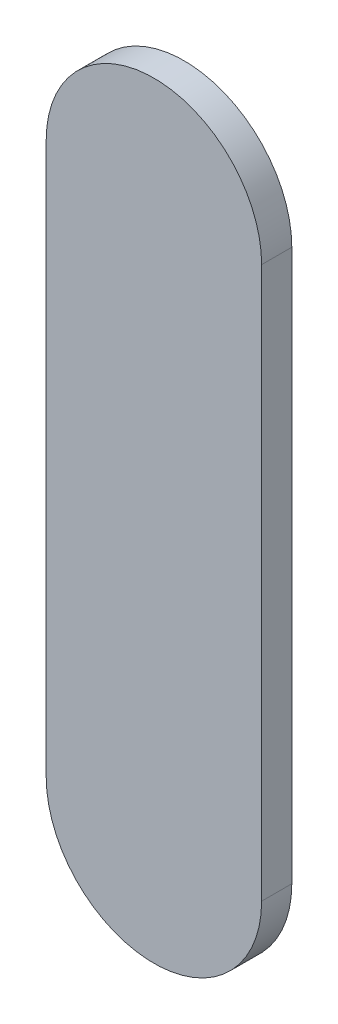
ISO-10303-21;
HEADER;
FILE_DESCRIPTION(('STEP AP214'),'2;1');
FILE_NAME('part.step','',(''),(''),'','','');
FILE_SCHEMA(('AUTOMOTIVE_DESIGN { 1 0 10303 214 1 1 1 1 }'));
ENDSEC;
DATA;
#1=APPLICATION_CONTEXT('core data for automotive mechanical design processes');
#2=APPLICATION_PROTOCOL_DEFINITION('international standard','automotive_design',2000,#1);
#3=PRODUCT_CONTEXT('',#1,'mechanical');
#4=PRODUCT('Part','Part','',(#3));
#5=PRODUCT_RELATED_PRODUCT_CATEGORY('part','',(#4));
#6=PRODUCT_DEFINITION_FORMATION('','',#4);
#7=PRODUCT_DEFINITION_CONTEXT('part definition',#1,'design');
#8=PRODUCT_DEFINITION('design','',#6,#7);
#9=PRODUCT_DEFINITION_SHAPE('','',#8);
#10=(LENGTH_UNIT() NAMED_UNIT(*) SI_UNIT(.MILLI.,.METRE.));
#11=(NAMED_UNIT(*) PLANE_ANGLE_UNIT() SI_UNIT($,.RADIAN.));
#12=(NAMED_UNIT(*) SI_UNIT($,.STERADIAN.) SOLID_ANGLE_UNIT());
#13=UNCERTAINTY_MEASURE_WITH_UNIT(LENGTH_MEASURE(1.E-05),#10,'distance_accuracy_value','');
#14=(GEOMETRIC_REPRESENTATION_CONTEXT(3) GLOBAL_UNCERTAINTY_ASSIGNED_CONTEXT((#13)) GLOBAL_UNIT_ASSIGNED_CONTEXT((#10,
#11,#12)) REPRESENTATION_CONTEXT('',''));
#15=CARTESIAN_POINT('',(0.,0.,0.));
#16=DIRECTION('',(0.,0.,1.));
#17=DIRECTION('',(1.,0.,0.));
#18=AXIS2_PLACEMENT_3D('',#15,#16,#17);
#19=CARTESIAN_POINT('',(95.394018,83.5370186,0.));
#20=DIRECTION('',(-1.,0.,0.));
#21=DIRECTION('',(0.,1.,0.));
#22=AXIS2_PLACEMENT_3D('',#19,#20,#21);
#23=PLANE('',#22);
#24=DIRECTION('',(0.,1.,0.));
#25=VECTOR('',#24,1.);
#26=CARTESIAN_POINT('',(95.394018,83.5370186,0.03556));
#27=LINE('',#26,#25);
#28=CARTESIAN_POINT('',(95.394018,83.5370186,0.03556));
#29=VERTEX_POINT('',#28);
#30=CARTESIAN_POINT('',(95.394018,84.1869284,0.03556));
#31=VERTEX_POINT('',#30);
#32=EDGE_CURVE('E11',#29,#31,#27,.T.);
#33=ORIENTED_EDGE('',*,*,#32,.F.);
#34=DIRECTION('',(0.,0.,1.));
#35=VECTOR('',#34,1.);
#36=CARTESIAN_POINT('',(95.394018,83.5370186,0.));
#37=LINE('',#36,#35);
#38=CARTESIAN_POINT('',(95.394018,83.5370186,0.));
#39=VERTEX_POINT('',#38);
#40=EDGE_CURVE('E24',#39,#29,#37,.T.);
#41=ORIENTED_EDGE('',*,*,#40,.F.);
#42=DIRECTION('',(0.,1.,0.));
#43=VECTOR('',#42,1.);
#44=CARTESIAN_POINT('',(95.394018,83.5370186,0.));
#45=LINE('',#44,#43);
#46=CARTESIAN_POINT('',(95.394018,84.1869284,0.));
#47=VERTEX_POINT('',#46);
#48=EDGE_CURVE('E75',#39,#47,#45,.T.);
#49=ORIENTED_EDGE('',*,*,#48,.T.);
#50=DIRECTION('',(0.,0.,1.));
#51=VECTOR('',#50,1.);
#52=CARTESIAN_POINT('',(95.394018,84.1869284,0.));
#53=LINE('',#52,#51);
#54=EDGE_CURVE('E37',#47,#31,#53,.T.);
#55=ORIENTED_EDGE('',*,*,#54,.T.);
#56=EDGE_LOOP('',(#33,#41,#49,#55));
#57=FACE_BOUND('',#56,.T.);
#58=ADVANCED_FACE('F17',(#57),#23,.F.);
#59=CARTESIAN_POINT('',(95.267018,84.1869284,0.));
#60=DIRECTION('',(0.,0.,-1.));
#61=DIRECTION('',(1.,-1.11896493820492E-13,0.));
#62=AXIS2_PLACEMENT_3D('',#59,#60,#61);
#63=CYLINDRICAL_SURFACE('',#62,0.126999999999991);
#64=CARTESIAN_POINT('',(95.267018,84.1869284,0.03556));
#65=DIRECTION('',(0.,0.,1.));
#66=DIRECTION('',(1.,-1.11896493820492E-13,0.));
#67=AXIS2_PLACEMENT_3D('',#64,#65,#66);
#68=CIRCLE('',#67,0.126999999999991);
#69=CARTESIAN_POINT('',(95.140018,84.1869284,0.03556));
#70=VERTEX_POINT('',#69);
#71=EDGE_CURVE('E83',#31,#70,#68,.T.);
#72=ORIENTED_EDGE('',*,*,#71,.F.);
#73=ORIENTED_EDGE('',*,*,#54,.F.);
#74=CARTESIAN_POINT('',(95.267018,84.1869284,0.));
#75=DIRECTION('',(0.,0.,1.));
#76=DIRECTION('',(1.,-1.11896493820492E-13,0.));
#77=AXIS2_PLACEMENT_3D('',#74,#75,#76);
#78=CIRCLE('',#77,0.126999999999991);
#79=CARTESIAN_POINT('',(95.140018,84.1869284,0.));
#80=VERTEX_POINT('',#79);
#81=EDGE_CURVE('E81',#47,#80,#78,.T.);
#82=ORIENTED_EDGE('',*,*,#81,.T.);
#83=DIRECTION('',(0.,0.,1.));
#84=VECTOR('',#83,1.);
#85=CARTESIAN_POINT('',(95.140018,84.1869284,0.));
#86=LINE('',#85,#84);
#87=EDGE_CURVE('E67',#80,#70,#86,.T.);
#88=ORIENTED_EDGE('',*,*,#87,.T.);
#89=EDGE_LOOP('',(#72,#73,#82,#88));
#90=FACE_BOUND('',#89,.T.);
#91=ADVANCED_FACE('F89',(#90),#63,.T.);
#92=CARTESIAN_POINT('',(95.140018,84.1869284,0.));
#93=DIRECTION('',(1.,0.,0.));
#94=DIRECTION('',(0.,-1.,0.));
#95=AXIS2_PLACEMENT_3D('',#92,#93,#94);
#96=PLANE('',#95);
#97=DIRECTION('',(0.,-1.,0.));
#98=VECTOR('',#97,1.);
#99=CARTESIAN_POINT('',(95.140018,84.1869284,0.03556));
#100=LINE('',#99,#98);
#101=CARTESIAN_POINT('',(95.140018,83.5370186,0.03556));
#102=VERTEX_POINT('',#101);
#103=EDGE_CURVE('E71',#70,#102,#100,.T.);
#104=ORIENTED_EDGE('',*,*,#103,.F.);
#105=ORIENTED_EDGE('',*,*,#87,.F.);
#106=DIRECTION('',(0.,-1.,0.));
#107=VECTOR('',#106,1.);
#108=CARTESIAN_POINT('',(95.140018,84.1869284,0.));
#109=LINE('',#108,#107);
#110=CARTESIAN_POINT('',(95.140018,83.5370186,0.));
#111=VERTEX_POINT('',#110);
#112=EDGE_CURVE('E63',#80,#111,#109,.T.);
#113=ORIENTED_EDGE('',*,*,#112,.T.);
#114=DIRECTION('',(0.,0.,1.));
#115=VECTOR('',#114,1.);
#116=CARTESIAN_POINT('',(95.140018,83.5370186,0.));
#117=LINE('',#116,#115);
#118=EDGE_CURVE('E53',#111,#102,#117,.T.);
#119=ORIENTED_EDGE('',*,*,#118,.T.);
#120=EDGE_LOOP('',(#104,#105,#113,#119));
#121=FACE_BOUND('',#120,.T.);
#122=ADVANCED_FACE('F66',(#121),#96,.F.);
#123=CARTESIAN_POINT('',(95.267018,83.5370186,0.));
#124=DIRECTION('',(0.,0.,-1.));
#125=DIRECTION('',(-1.,0.,0.));
#126=AXIS2_PLACEMENT_3D('',#123,#124,#125);
#127=CYLINDRICAL_SURFACE('',#126,0.126999999999995);
#128=CARTESIAN_POINT('',(95.267018,83.5370186,0.03556));
#129=DIRECTION('',(0.,0.,1.));
#130=DIRECTION('',(-1.,0.,0.));
#131=AXIS2_PLACEMENT_3D('',#128,#129,#130);
#132=CIRCLE('',#131,0.126999999999995);
#133=EDGE_CURVE('E59',#102,#29,#132,.T.);
#134=ORIENTED_EDGE('',*,*,#133,.F.);
#135=ORIENTED_EDGE('',*,*,#118,.F.);
#136=CARTESIAN_POINT('',(95.267018,83.5370186,0.));
#137=DIRECTION('',(0.,0.,1.));
#138=DIRECTION('',(-1.,0.,0.));
#139=AXIS2_PLACEMENT_3D('',#136,#137,#138);
#140=CIRCLE('',#139,0.126999999999995);
#141=EDGE_CURVE('E57',#111,#39,#140,.T.);
#142=ORIENTED_EDGE('',*,*,#141,.T.);
#143=ORIENTED_EDGE('',*,*,#40,.T.);
#144=EDGE_LOOP('',(#134,#135,#142,#143));
#145=FACE_BOUND('',#144,.T.);
#146=ADVANCED_FACE('F55',(#145),#127,.T.);
#147=CARTESIAN_POINT('',(95.394018,83.5370186,0.));
#148=DIRECTION('',(0.,0.,-1.));
#149=DIRECTION('',(-1.,0.,0.));
#150=AXIS2_PLACEMENT_3D('',#147,#148,#149);
#151=PLANE('',#150);
#152=ORIENTED_EDGE('',*,*,#141,.F.);
#153=ORIENTED_EDGE('',*,*,#112,.F.);
#154=ORIENTED_EDGE('',*,*,#81,.F.);
#155=ORIENTED_EDGE('',*,*,#48,.F.);
#156=EDGE_LOOP('',(#152,#153,#154,#155));
#157=FACE_BOUND('',#156,.T.);
#158=ADVANCED_FACE('F74',(#157),#151,.T.);
#159=CARTESIAN_POINT('',(95.394018,83.5370186,0.03556));
#160=DIRECTION('',(0.,0.,-1.));
#161=DIRECTION('',(-1.,0.,0.));
#162=AXIS2_PLACEMENT_3D('',#159,#160,#161);
#163=PLANE('',#162);
#164=ORIENTED_EDGE('',*,*,#32,.T.);
#165=ORIENTED_EDGE('',*,*,#71,.T.);
#166=ORIENTED_EDGE('',*,*,#103,.T.);
#167=ORIENTED_EDGE('',*,*,#133,.T.);
#168=EDGE_LOOP('',(#164,#165,#166,#167));
#169=FACE_BOUND('',#168,.T.);
#170=ADVANCED_FACE('F91',(#169),#163,.F.);
#171=CLOSED_SHELL('',(#58,#91,#122,#146,#158,#170));
#172=MANIFOLD_SOLID_BREP('B1',#171);
#173=ADVANCED_BREP_SHAPE_REPRESENTATION('',(#18,#172),#14);
#174=SHAPE_DEFINITION_REPRESENTATION(#9,#173);
ENDSEC;
END-ISO-10303-21;
